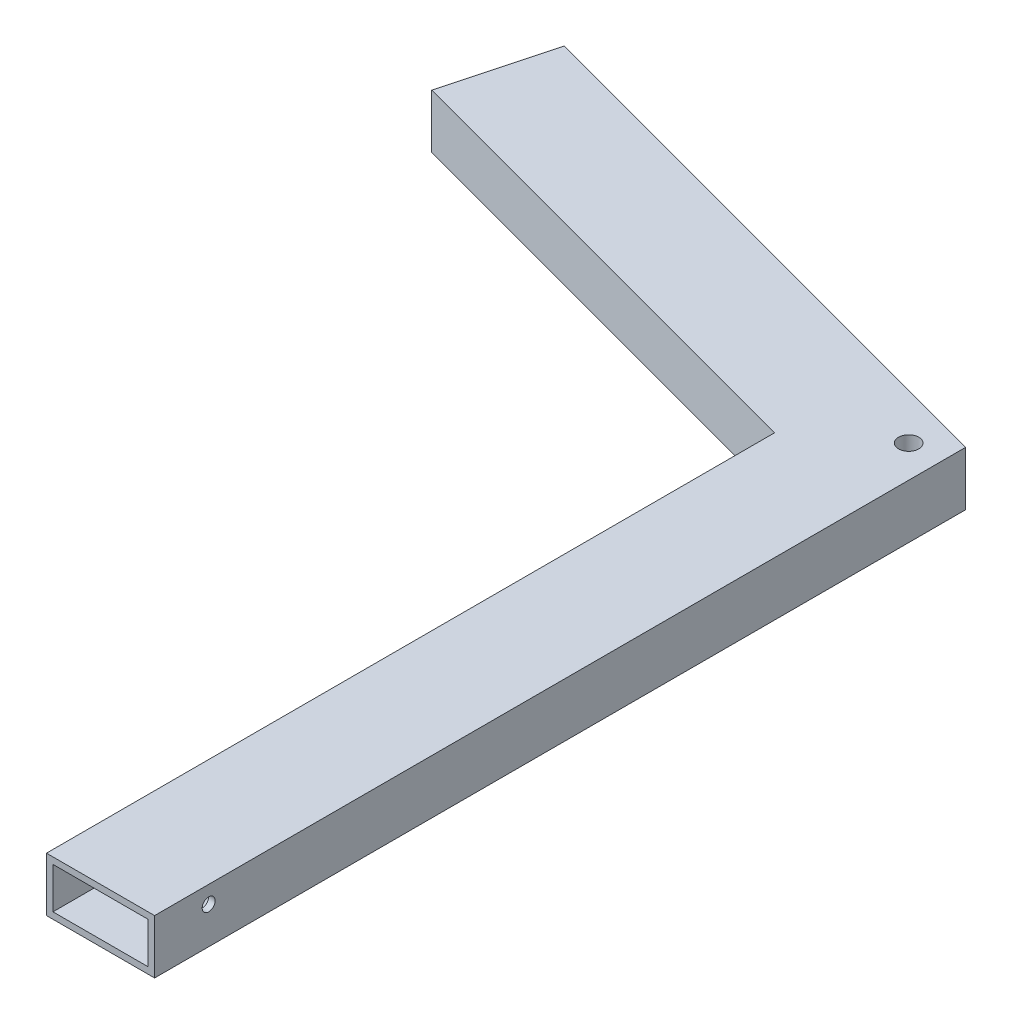
ISO-10303-21;
HEADER;
FILE_DESCRIPTION(('STEP AP214'),'2;1');
FILE_NAME('part.step','',(''),(''),'','','');
FILE_SCHEMA(('AUTOMOTIVE_DESIGN { 1 0 10303 214 1 1 1 1 }'));
ENDSEC;
DATA;
#1=APPLICATION_CONTEXT('core data for automotive mechanical design processes');
#2=APPLICATION_PROTOCOL_DEFINITION('international standard','automotive_design',2000,#1);
#3=PRODUCT_CONTEXT('',#1,'mechanical');
#4=PRODUCT('Part','Part','',(#3));
#5=PRODUCT_RELATED_PRODUCT_CATEGORY('part','',(#4));
#6=PRODUCT_DEFINITION_FORMATION('','',#4);
#7=PRODUCT_DEFINITION_CONTEXT('part definition',#1,'design');
#8=PRODUCT_DEFINITION('design','',#6,#7);
#9=PRODUCT_DEFINITION_SHAPE('','',#8);
#10=(LENGTH_UNIT() NAMED_UNIT(*) SI_UNIT(.MILLI.,.METRE.));
#11=(NAMED_UNIT(*) PLANE_ANGLE_UNIT() SI_UNIT($,.RADIAN.));
#12=(NAMED_UNIT(*) SI_UNIT($,.STERADIAN.) SOLID_ANGLE_UNIT());
#13=UNCERTAINTY_MEASURE_WITH_UNIT(LENGTH_MEASURE(1.E-05),#10,'distance_accuracy_value','');
#14=(GEOMETRIC_REPRESENTATION_CONTEXT(3) GLOBAL_UNCERTAINTY_ASSIGNED_CONTEXT((#13)) GLOBAL_UNIT_ASSIGNED_CONTEXT((#10,
#11,#12)) REPRESENTATION_CONTEXT('',''));
#15=CARTESIAN_POINT('',(0.,0.,0.));
#16=DIRECTION('',(0.,0.,1.));
#17=DIRECTION('',(1.,0.,0.));
#18=AXIS2_PLACEMENT_3D('',#15,#16,#17);
#19=CARTESIAN_POINT('',(-257.612417871295,25.4,-259.527039328841));
#20=DIRECTION('',(0.965925826289069,0.,0.258819045102517));
#21=DIRECTION('',(0.258819045102517,0.,-0.965925826289069));
#22=AXIS2_PLACEMENT_3D('',#19,#20,#21);
#23=PLANE('',#22);
#24=DIRECTION('',(0.,-1.,0.));
#25=VECTOR('',#24,1.);
#26=CARTESIAN_POINT('',(-269.971544913032,22.352,-213.40214927188));
#27=LINE('',#26,#25);
#28=CARTESIAN_POINT('',(-269.971544913032,22.352,-213.40214927188));
#29=VERTEX_POINT('',#28);
#30=CARTESIAN_POINT('',(-269.971544913032,3.048,-213.40214927188));
#31=VERTEX_POINT('',#30);
#32=EDGE_CURVE('E167',#29,#31,#27,.T.);
#33=ORIENTED_EDGE('',*,*,#32,.T.);
#34=DIRECTION('',(0.258819045102517,0.,-0.965925826289069));
#35=VECTOR('',#34,1.);
#36=CARTESIAN_POINT('',(-258.401298320769,3.048,-256.582897410306));
#37=LINE('',#36,#35);
#38=CARTESIAN_POINT('',(-258.401298320769,3.048,-256.582897410306));
#39=VERTEX_POINT('',#38);
#40=EDGE_CURVE('E145',#31,#39,#37,.T.);
#41=ORIENTED_EDGE('',*,*,#40,.T.);
#42=DIRECTION('',(0.,1.,0.));
#43=VECTOR('',#42,1.);
#44=CARTESIAN_POINT('',(-258.401298320769,22.352,-256.582897410306));
#45=LINE('',#44,#43);
#46=CARTESIAN_POINT('',(-258.401298320769,22.352,-256.582897410306));
#47=VERTEX_POINT('',#46);
#48=EDGE_CURVE('E141',#39,#47,#45,.T.);
#49=ORIENTED_EDGE('',*,*,#48,.T.);
#50=DIRECTION('',(-0.258819045102517,0.,0.965925826289069));
#51=VECTOR('',#50,1.);
#52=CARTESIAN_POINT('',(-258.401298320769,22.352,-256.582897410306));
#53=LINE('',#52,#51);
#54=EDGE_CURVE('E174',#47,#29,#53,.T.);
#55=ORIENTED_EDGE('',*,*,#54,.T.);
#56=EDGE_LOOP('',(#33,#41,#49,#55));
#57=FACE_BOUND('',#56,.T.);
#58=DIRECTION('',(-0.258819045102517,0.,0.965925826289069));
#59=VECTOR('',#58,1.);
#60=CARTESIAN_POINT('',(-257.612417871295,0.,-259.527039328841));
#61=LINE('',#60,#59);
#62=CARTESIAN_POINT('',(-257.612417871295,0.,-259.527039328841));
#63=VERTEX_POINT('',#62);
#64=CARTESIAN_POINT('',(-270.760425362503,0.,-210.458007353357));
#65=VERTEX_POINT('',#64);
#66=EDGE_CURVE('E202',#63,#65,#61,.T.);
#67=ORIENTED_EDGE('',*,*,#66,.T.);
#68=DIRECTION('',(0.,-1.,0.));
#69=VECTOR('',#68,1.);
#70=CARTESIAN_POINT('',(-270.760425362503,25.4,-210.458007353357));
#71=LINE('',#70,#69);
#72=CARTESIAN_POINT('',(-270.760425362503,25.4,-210.458007353357));
#73=VERTEX_POINT('',#72);
#74=EDGE_CURVE('E11',#73,#65,#71,.T.);
#75=ORIENTED_EDGE('',*,*,#74,.F.);
#76=DIRECTION('',(-0.258819045102517,0.,0.965925826289069));
#77=VECTOR('',#76,1.);
#78=CARTESIAN_POINT('',(-257.612417871295,25.4,-259.527039328841));
#79=LINE('',#78,#77);
#80=CARTESIAN_POINT('',(-257.612417871295,25.4,-259.527039328841));
#81=VERTEX_POINT('',#80);
#82=EDGE_CURVE('E204',#81,#73,#79,.T.);
#83=ORIENTED_EDGE('',*,*,#82,.F.);
#84=DIRECTION('',(0.,-1.,0.));
#85=VECTOR('',#84,1.);
#86=CARTESIAN_POINT('',(-257.612417871295,25.4,-259.527039328841));
#87=LINE('',#86,#85);
#88=EDGE_CURVE('E219',#81,#63,#87,.T.);
#89=ORIENTED_EDGE('',*,*,#88,.T.);
#90=EDGE_LOOP('',(#67,#75,#83,#89));
#91=FACE_BOUND('',#90,.T.);
#92=ADVANCED_FACE('F36',(#57,#91),#23,.F.);
#93=CARTESIAN_POINT('',(-270.760425362503,25.4,-210.458007353357));
#94=DIRECTION('',(0.258819045102518,0.,-0.965925826289069));
#95=DIRECTION('',(-0.965925826289069,0.,-0.258819045102518));
#96=AXIS2_PLACEMENT_3D('',#93,#94,#95);
#97=PLANE('',#96);
#98=DIRECTION('',(0.965925826289069,0.,0.258819045102518));
#99=VECTOR('',#98,1.);
#100=CARTESIAN_POINT('',(-270.760425362503,0.,-210.458007353357));
#101=LINE('',#100,#99);
#102=CARTESIAN_POINT('',(-50.8,0.,-151.519789010669));
#103=VERTEX_POINT('',#102);
#104=EDGE_CURVE('E222',#65,#103,#101,.T.);
#105=ORIENTED_EDGE('',*,*,#104,.T.);
#106=DIRECTION('',(0.,-1.,0.));
#107=VECTOR('',#106,1.);
#108=CARTESIAN_POINT('',(-50.8,25.4,-151.519789010669));
#109=LINE('',#108,#107);
#110=CARTESIAN_POINT('',(-50.8,25.4,-151.519789010669));
#111=VERTEX_POINT('',#110);
#112=EDGE_CURVE('E44',#111,#103,#109,.T.);
#113=ORIENTED_EDGE('',*,*,#112,.F.);
#114=DIRECTION('',(0.965925826289069,0.,0.258819045102518));
#115=VECTOR('',#114,1.);
#116=CARTESIAN_POINT('',(-270.760425362503,25.4,-210.458007353357));
#117=LINE('',#116,#115);
#118=EDGE_CURVE('E207',#73,#111,#117,.T.);
#119=ORIENTED_EDGE('',*,*,#118,.F.);
#120=ORIENTED_EDGE('',*,*,#74,.T.);
#121=EDGE_LOOP('',(#105,#113,#119,#120));
#122=FACE_BOUND('',#121,.T.);
#123=ADVANCED_FACE('F265',(#122),#97,.F.);
#124=CARTESIAN_POINT('',(-50.8,25.4,-151.519789010669));
#125=DIRECTION('',(1.,0.,0.));
#126=DIRECTION('',(0.,0.,-1.));
#127=AXIS2_PLACEMENT_3D('',#124,#125,#126);
#128=PLANE('',#127);
#129=CARTESIAN_POINT('',(-50.8,17.272,165.1));
#130=DIRECTION('',(1.,0.,0.));
#131=DIRECTION('',(0.,0.,-1.));
#132=AXIS2_PLACEMENT_3D('',#129,#130,#131);
#133=CIRCLE('',#132,3.04800000000001);
#134=CARTESIAN_POINT('',(-50.8,17.272,162.052));
#135=VERTEX_POINT('',#134);
#136=EDGE_CURVE('E296',#135,#135,#133,.T.);
#137=ORIENTED_EDGE('',*,*,#136,.T.);
#138=EDGE_LOOP('',(#137));
#139=FACE_BOUND('',#138,.T.);
#140=DIRECTION('',(0.,0.,1.));
#141=VECTOR('',#140,1.);
#142=CARTESIAN_POINT('',(-50.8,0.,-151.519789010669));
#143=LINE('',#142,#141);
#144=CARTESIAN_POINT('',(-50.7999999999999,0.,190.5));
#145=VERTEX_POINT('',#144);
#146=EDGE_CURVE('E224',#103,#145,#143,.T.);
#147=ORIENTED_EDGE('',*,*,#146,.T.);
#148=DIRECTION('',(0.,-1.,0.));
#149=VECTOR('',#148,1.);
#150=CARTESIAN_POINT('',(-50.7999999999999,25.4,190.5));
#151=LINE('',#150,#149);
#152=CARTESIAN_POINT('',(-50.7999999999999,25.4,190.5));
#153=VERTEX_POINT('',#152);
#154=EDGE_CURVE('E239',#153,#145,#151,.T.);
#155=ORIENTED_EDGE('',*,*,#154,.F.);
#156=DIRECTION('',(0.,0.,1.));
#157=VECTOR('',#156,1.);
#158=CARTESIAN_POINT('',(-50.8,25.4,-151.519789010669));
#159=LINE('',#158,#157);
#160=EDGE_CURVE('E210',#111,#153,#159,.T.);
#161=ORIENTED_EDGE('',*,*,#160,.F.);
#162=ORIENTED_EDGE('',*,*,#112,.T.);
#163=EDGE_LOOP('',(#147,#155,#161,#162));
#164=FACE_BOUND('',#163,.T.);
#165=ADVANCED_FACE('F247',(#139,#164),#128,.F.);
#166=CARTESIAN_POINT('',(-50.7999999999999,25.4,190.5));
#167=DIRECTION('',(0.,0.,-1.));
#168=DIRECTION('',(-1.,0.,0.));
#169=AXIS2_PLACEMENT_3D('',#166,#167,#168);
#170=PLANE('',#169);
#171=DIRECTION('',(0.,-1.,0.));
#172=VECTOR('',#171,1.);
#173=CARTESIAN_POINT('',(-47.752,22.352,190.5));
#174=LINE('',#173,#172);
#175=CARTESIAN_POINT('',(-47.752,22.352,190.5));
#176=VERTEX_POINT('',#175);
#177=CARTESIAN_POINT('',(-47.752,3.048,190.5));
#178=VERTEX_POINT('',#177);
#179=EDGE_CURVE('E159',#176,#178,#174,.T.);
#180=ORIENTED_EDGE('',*,*,#179,.F.);
#181=DIRECTION('',(-1.,0.,0.));
#182=VECTOR('',#181,1.);
#183=CARTESIAN_POINT('',(-47.752,22.352,190.5));
#184=LINE('',#183,#182);
#185=CARTESIAN_POINT('',(-3.04799999999994,22.352,190.5));
#186=VERTEX_POINT('',#185);
#187=EDGE_CURVE('E59',#186,#176,#184,.T.);
#188=ORIENTED_EDGE('',*,*,#187,.F.);
#189=DIRECTION('',(0.,1.,0.));
#190=VECTOR('',#189,1.);
#191=CARTESIAN_POINT('',(-3.04799999999994,22.352,190.5));
#192=LINE('',#191,#190);
#193=CARTESIAN_POINT('',(-3.04799999999994,3.048,190.5));
#194=VERTEX_POINT('',#193);
#195=EDGE_CURVE('E178',#194,#186,#192,.T.);
#196=ORIENTED_EDGE('',*,*,#195,.F.);
#197=DIRECTION('',(1.,0.,0.));
#198=VECTOR('',#197,1.);
#199=CARTESIAN_POINT('',(-47.752,3.048,190.5));
#200=LINE('',#199,#198);
#201=EDGE_CURVE('E163',#178,#194,#200,.T.);
#202=ORIENTED_EDGE('',*,*,#201,.F.);
#203=EDGE_LOOP('',(#180,#188,#196,#202));
#204=FACE_BOUND('',#203,.T.);
#205=DIRECTION('',(1.,0.,0.));
#206=VECTOR('',#205,1.);
#207=CARTESIAN_POINT('',(-50.7999999999999,0.,190.5));
#208=LINE('',#207,#206);
#209=CARTESIAN_POINT('',(0.,0.,190.5));
#210=VERTEX_POINT('',#209);
#211=EDGE_CURVE('E226',#145,#210,#208,.T.);
#212=ORIENTED_EDGE('',*,*,#211,.T.);
#213=DIRECTION('',(0.,-1.,0.));
#214=VECTOR('',#213,1.);
#215=CARTESIAN_POINT('',(0.,25.4,190.5));
#216=LINE('',#215,#214);
#217=CARTESIAN_POINT('',(0.,25.4,190.5));
#218=VERTEX_POINT('',#217);
#219=EDGE_CURVE('E237',#218,#210,#216,.T.);
#220=ORIENTED_EDGE('',*,*,#219,.F.);
#221=DIRECTION('',(1.,0.,0.));
#222=VECTOR('',#221,1.);
#223=CARTESIAN_POINT('',(-50.7999999999999,25.4,190.5));
#224=LINE('',#223,#222);
#225=EDGE_CURVE('E212',#153,#218,#224,.T.);
#226=ORIENTED_EDGE('',*,*,#225,.F.);
#227=ORIENTED_EDGE('',*,*,#154,.T.);
#228=EDGE_LOOP('',(#212,#220,#226,#227));
#229=FACE_BOUND('',#228,.T.);
#230=ADVANCED_FACE('F258',(#204,#229),#170,.F.);
#231=CARTESIAN_POINT('',(0.,25.4,-190.5));
#232=DIRECTION('',(1.,0.,0.));
#233=DIRECTION('',(0.,0.,-1.));
#234=AXIS2_PLACEMENT_3D('',#231,#232,#233);
#235=PLANE('',#234);
#236=CARTESIAN_POINT('',(0.,17.272,165.1));
#237=DIRECTION('',(1.,0.,0.));
#238=DIRECTION('',(0.,0.,-1.));
#239=AXIS2_PLACEMENT_3D('',#236,#237,#238);
#240=CIRCLE('',#239,3.04800000000001);
#241=CARTESIAN_POINT('',(0.,17.272,162.052));
#242=VERTEX_POINT('',#241);
#243=EDGE_CURVE('E305',#242,#242,#240,.T.);
#244=ORIENTED_EDGE('',*,*,#243,.F.);
#245=EDGE_LOOP('',(#244));
#246=FACE_BOUND('',#245,.T.);
#247=DIRECTION('',(0.,0.,1.));
#248=VECTOR('',#247,1.);
#249=CARTESIAN_POINT('',(0.,0.,-190.5));
#250=LINE('',#249,#248);
#251=CARTESIAN_POINT('',(0.,0.,-190.5));
#252=VERTEX_POINT('',#251);
#253=EDGE_CURVE('E229',#252,#210,#250,.T.);
#254=ORIENTED_EDGE('',*,*,#253,.F.);
#255=DIRECTION('',(0.,-1.,0.));
#256=VECTOR('',#255,1.);
#257=CARTESIAN_POINT('',(0.,25.4,-190.5));
#258=LINE('',#257,#256);
#259=CARTESIAN_POINT('',(0.,25.4,-190.5));
#260=VERTEX_POINT('',#259);
#261=EDGE_CURVE('E235',#260,#252,#258,.T.);
#262=ORIENTED_EDGE('',*,*,#261,.F.);
#263=DIRECTION('',(0.,0.,1.));
#264=VECTOR('',#263,1.);
#265=CARTESIAN_POINT('',(0.,25.4,-190.5));
#266=LINE('',#265,#264);
#267=EDGE_CURVE('E214',#260,#218,#266,.T.);
#268=ORIENTED_EDGE('',*,*,#267,.T.);
#269=ORIENTED_EDGE('',*,*,#219,.T.);
#270=EDGE_LOOP('',(#254,#262,#268,#269));
#271=FACE_BOUND('',#270,.T.);
#272=ADVANCED_FACE('F270',(#246,#271),#235,.T.);
#273=CARTESIAN_POINT('',(0.,25.4,-190.5));
#274=DIRECTION('',(-0.258819045102518,0.,0.965925826289069));
#275=DIRECTION('',(0.965925826289069,0.,0.258819045102518));
#276=AXIS2_PLACEMENT_3D('',#273,#274,#275);
#277=PLANE('',#276);
#278=DIRECTION('',(-0.965925826289069,0.,-0.258819045102518));
#279=VECTOR('',#278,1.);
#280=CARTESIAN_POINT('',(0.,0.,-190.5));
#281=LINE('',#280,#279);
#282=EDGE_CURVE('E208',#252,#63,#281,.T.);
#283=ORIENTED_EDGE('',*,*,#282,.T.);
#284=ORIENTED_EDGE('',*,*,#88,.F.);
#285=DIRECTION('',(-0.965925826289069,0.,-0.258819045102518));
#286=VECTOR('',#285,1.);
#287=CARTESIAN_POINT('',(0.,25.4,-190.5));
#288=LINE('',#287,#286);
#289=EDGE_CURVE('E217',#260,#81,#288,.T.);
#290=ORIENTED_EDGE('',*,*,#289,.F.);
#291=ORIENTED_EDGE('',*,*,#261,.T.);
#292=EDGE_LOOP('',(#283,#284,#290,#291));
#293=FACE_BOUND('',#292,.T.);
#294=ADVANCED_FACE('F272',(#293),#277,.F.);
#295=CARTESIAN_POINT('',(0.,25.4,0.));
#296=DIRECTION('',(0.,1.,0.));
#297=DIRECTION('',(0.,0.,1.));
#298=AXIS2_PLACEMENT_3D('',#295,#296,#297);
#299=PLANE('',#298);
#300=CARTESIAN_POINT('',(-15.113381132548,25.4,-178.903094777384));
#301=DIRECTION('',(0.,-1.,0.));
#302=DIRECTION('',(0.,0.,-1.));
#303=AXIS2_PLACEMENT_3D('',#300,#301,#302);
#304=CIRCLE('',#303,4.7625);
#305=CARTESIAN_POINT('',(-15.113381132548,25.4,-183.665594777384));
#306=VERTEX_POINT('',#305);
#307=EDGE_CURVE('E308',#306,#306,#304,.T.);
#308=ORIENTED_EDGE('',*,*,#307,.T.);
#309=EDGE_LOOP('',(#308));
#310=FACE_BOUND('',#309,.T.);
#311=ORIENTED_EDGE('',*,*,#82,.T.);
#312=ORIENTED_EDGE('',*,*,#118,.T.);
#313=ORIENTED_EDGE('',*,*,#160,.T.);
#314=ORIENTED_EDGE('',*,*,#225,.T.);
#315=ORIENTED_EDGE('',*,*,#267,.F.);
#316=ORIENTED_EDGE('',*,*,#289,.T.);
#317=EDGE_LOOP('',(#311,#312,#313,#314,#315,#316));
#318=FACE_BOUND('',#317,.T.);
#319=ADVANCED_FACE('F262',(#310,#318),#299,.T.);
#320=CARTESIAN_POINT('',(0.,0.,0.));
#321=DIRECTION('',(0.,1.,0.));
#322=DIRECTION('',(0.,0.,1.));
#323=AXIS2_PLACEMENT_3D('',#320,#321,#322);
#324=PLANE('',#323);
#325=CARTESIAN_POINT('',(-15.113381132548,0.,-178.903094777384));
#326=DIRECTION('',(0.,-1.,0.));
#327=DIRECTION('',(0.,0.,-1.));
#328=AXIS2_PLACEMENT_3D('',#325,#326,#327);
#329=CIRCLE('',#328,4.7625);
#330=CARTESIAN_POINT('',(-15.113381132548,0.,-183.665594777384));
#331=VERTEX_POINT('',#330);
#332=EDGE_CURVE('E309',#331,#331,#329,.T.);
#333=ORIENTED_EDGE('',*,*,#332,.F.);
#334=EDGE_LOOP('',(#333));
#335=FACE_BOUND('',#334,.T.);
#336=ORIENTED_EDGE('',*,*,#66,.F.);
#337=ORIENTED_EDGE('',*,*,#282,.F.);
#338=ORIENTED_EDGE('',*,*,#253,.T.);
#339=ORIENTED_EDGE('',*,*,#211,.F.);
#340=ORIENTED_EDGE('',*,*,#146,.F.);
#341=ORIENTED_EDGE('',*,*,#104,.F.);
#342=EDGE_LOOP('',(#336,#337,#338,#339,#340,#341));
#343=FACE_BOUND('',#342,.T.);
#344=ADVANCED_FACE('F253',(#335,#343),#324,.F.);
#345=CARTESIAN_POINT('',(-270.760425362503,25.4,-210.458007353357));
#346=DIRECTION('',(0.258819045102518,0.,-0.965925826289069));
#347=DIRECTION('',(-0.965925826289069,0.,-0.258819045102518));
#348=AXIS2_PLACEMENT_3D('',#345,#346,#347);
#349=PLANE('',#348);
#350=DIRECTION('',(0.,-1.,0.));
#351=VECTOR('',#350,1.);
#352=CARTESIAN_POINT('',(-47.752,22.352,-150.703079872139));
#353=LINE('',#352,#351);
#354=CARTESIAN_POINT('',(-47.752,22.352,-150.703079872139));
#355=VERTEX_POINT('',#354);
#356=CARTESIAN_POINT('',(-47.752,3.048,-150.703079872139));
#357=VERTEX_POINT('',#356);
#358=EDGE_CURVE('E187',#355,#357,#353,.T.);
#359=ORIENTED_EDGE('',*,*,#358,.T.);
#360=DIRECTION('',(0.965925826289069,0.,0.258819045102518));
#361=VECTOR('',#360,1.);
#362=CARTESIAN_POINT('',(-48.8112267571591,3.048,-150.986898826321));
#363=LINE('',#362,#361);
#364=CARTESIAN_POINT('',(-3.04799999999994,3.048,-138.724679173698));
#365=VERTEX_POINT('',#364);
#366=EDGE_CURVE('E192',#357,#365,#363,.T.);
#367=ORIENTED_EDGE('',*,*,#366,.T.);
#368=DIRECTION('',(0.,1.,0.));
#369=VECTOR('',#368,1.);
#370=CARTESIAN_POINT('',(-3.04799999999994,22.352,-138.724679173698));
#371=LINE('',#370,#369);
#372=CARTESIAN_POINT('',(-3.04799999999994,22.352,-138.724679173698));
#373=VERTEX_POINT('',#372);
#374=EDGE_CURVE('E196',#365,#373,#371,.T.);
#375=ORIENTED_EDGE('',*,*,#374,.T.);
#376=DIRECTION('',(-0.965925826289069,0.,-0.258819045102518));
#377=VECTOR('',#376,1.);
#378=CARTESIAN_POINT('',(-48.8112267571591,22.352,-150.986898826321));
#379=LINE('',#378,#377);
#380=EDGE_CURVE('E177',#373,#355,#379,.T.);
#381=ORIENTED_EDGE('',*,*,#380,.T.);
#382=EDGE_LOOP('',(#359,#367,#375,#381));
#383=FACE_BOUND('',#382,.T.);
#384=ADVANCED_FACE('F323',(#383),#349,.F.);
#385=CARTESIAN_POINT('',(-47.752,22.352,-154.939986900775));
#386=DIRECTION('',(0.,1.,0.));
#387=DIRECTION('',(0.,0.,1.));
#388=AXIS2_PLACEMENT_3D('',#385,#386,#387);
#389=PLANE('',#388);
#390=DIRECTION('',(0.,0.,1.));
#391=VECTOR('',#390,1.);
#392=CARTESIAN_POINT('',(-3.04799999999994,22.352,-154.939986900775));
#393=LINE('',#392,#391);
#394=EDGE_CURVE('E195',#373,#186,#393,.T.);
#395=ORIENTED_EDGE('',*,*,#394,.T.);
#396=ORIENTED_EDGE('',*,*,#187,.T.);
#397=DIRECTION('',(0.,0.,1.));
#398=VECTOR('',#397,1.);
#399=CARTESIAN_POINT('',(-47.752,22.352,-154.939986900775));
#400=LINE('',#399,#398);
#401=EDGE_CURVE('E186',#355,#176,#400,.T.);
#402=ORIENTED_EDGE('',*,*,#401,.F.);
#403=ORIENTED_EDGE('',*,*,#380,.F.);
#404=EDGE_LOOP('',(#395,#396,#402,#403));
#405=FACE_BOUND('',#404,.T.);
#406=ADVANCED_FACE('F327',(#405),#389,.F.);
#407=CARTESIAN_POINT('',(-3.04799999999994,22.352,-154.939986900775));
#408=DIRECTION('',(1.,0.,0.));
#409=DIRECTION('',(0.,0.,-1.));
#410=AXIS2_PLACEMENT_3D('',#407,#408,#409);
#411=PLANE('',#410);
#412=CARTESIAN_POINT('',(-3.04799999999994,17.272,165.1));
#413=DIRECTION('',(1.,0.,0.));
#414=DIRECTION('',(0.,0.,-1.));
#415=AXIS2_PLACEMENT_3D('',#412,#413,#414);
#416=CIRCLE('',#415,3.04800000000001);
#417=CARTESIAN_POINT('',(-3.04799999999994,17.272,162.052));
#418=VERTEX_POINT('',#417);
#419=EDGE_CURVE('E302',#418,#418,#416,.T.);
#420=ORIENTED_EDGE('',*,*,#419,.T.);
#421=EDGE_LOOP('',(#420));
#422=FACE_BOUND('',#421,.T.);
#423=DIRECTION('',(0.,0.,1.));
#424=VECTOR('',#423,1.);
#425=CARTESIAN_POINT('',(-3.04799999999994,3.048,-154.939986900775));
#426=LINE('',#425,#424);
#427=EDGE_CURVE('E191',#365,#194,#426,.T.);
#428=ORIENTED_EDGE('',*,*,#427,.T.);
#429=ORIENTED_EDGE('',*,*,#195,.T.);
#430=ORIENTED_EDGE('',*,*,#394,.F.);
#431=ORIENTED_EDGE('',*,*,#374,.F.);
#432=EDGE_LOOP('',(#428,#429,#430,#431));
#433=FACE_BOUND('',#432,.T.);
#434=ADVANCED_FACE('F333',(#422,#433),#411,.F.);
#435=CARTESIAN_POINT('',(-47.752,3.048,-154.939986900775));
#436=DIRECTION('',(0.,-1.,0.));
#437=DIRECTION('',(0.,0.,-1.));
#438=AXIS2_PLACEMENT_3D('',#435,#436,#437);
#439=PLANE('',#438);
#440=DIRECTION('',(0.,0.,1.));
#441=VECTOR('',#440,1.);
#442=CARTESIAN_POINT('',(-47.752,3.048,-154.939986900775));
#443=LINE('',#442,#441);
#444=EDGE_CURVE('E190',#357,#178,#443,.T.);
#445=ORIENTED_EDGE('',*,*,#444,.T.);
#446=ORIENTED_EDGE('',*,*,#201,.T.);
#447=ORIENTED_EDGE('',*,*,#427,.F.);
#448=ORIENTED_EDGE('',*,*,#366,.F.);
#449=EDGE_LOOP('',(#445,#446,#447,#448));
#450=FACE_BOUND('',#449,.T.);
#451=ADVANCED_FACE('F336',(#450),#439,.F.);
#452=CARTESIAN_POINT('',(-47.752,22.352,-154.939986900775));
#453=DIRECTION('',(-1.,0.,0.));
#454=DIRECTION('',(0.,0.,1.));
#455=AXIS2_PLACEMENT_3D('',#452,#453,#454);
#456=PLANE('',#455);
#457=CARTESIAN_POINT('',(-47.752,17.272,165.1));
#458=DIRECTION('',(-1.,0.,0.));
#459=DIRECTION('',(0.,0.,1.));
#460=AXIS2_PLACEMENT_3D('',#457,#458,#459);
#461=CIRCLE('',#460,3.04800000000001);
#462=CARTESIAN_POINT('',(-47.752,17.272,168.148));
#463=VERTEX_POINT('',#462);
#464=EDGE_CURVE('E39',#463,#463,#461,.T.);
#465=ORIENTED_EDGE('',*,*,#464,.T.);
#466=EDGE_LOOP('',(#465));
#467=FACE_BOUND('',#466,.T.);
#468=ORIENTED_EDGE('',*,*,#401,.T.);
#469=ORIENTED_EDGE('',*,*,#179,.T.);
#470=ORIENTED_EDGE('',*,*,#444,.F.);
#471=ORIENTED_EDGE('',*,*,#358,.F.);
#472=EDGE_LOOP('',(#468,#469,#470,#471));
#473=FACE_BOUND('',#472,.T.);
#474=ADVANCED_FACE('F340',(#467,#473),#456,.F.);
#475=CARTESIAN_POINT('',(-260.600902574396,22.352,-257.172279593733));
#476=DIRECTION('',(0.,-1.,0.));
#477=DIRECTION('',(0.,0.,-1.));
#478=AXIS2_PLACEMENT_3D('',#475,#476,#477);
#479=PLANE('',#478);
#480=DIRECTION('',(0.,0.,1.));
#481=VECTOR('',#480,1.);
#482=CARTESIAN_POINT('',(-50.8,22.352,-257.172279593733));
#483=LINE('',#482,#481);
#484=CARTESIAN_POINT('',(-50.8,22.352,-200.956297177604));
#485=VERTEX_POINT('',#484);
#486=CARTESIAN_POINT('',(-50.7999999999999,22.352,-154.675310808552));
#487=VERTEX_POINT('',#486);
#488=EDGE_CURVE('E153',#485,#487,#483,.T.);
#489=ORIENTED_EDGE('',*,*,#488,.T.);
#490=DIRECTION('',(0.965925826289069,0.,0.258819045102519));
#491=VECTOR('',#490,1.);
#492=CARTESIAN_POINT('',(-272.171149166659,22.352,-213.991531455307));
#493=LINE('',#492,#491);
#494=EDGE_CURVE('E171',#29,#487,#493,.T.);
#495=ORIENTED_EDGE('',*,*,#494,.F.);
#496=ORIENTED_EDGE('',*,*,#54,.F.);
#497=DIRECTION('',(0.965925826289069,0.,0.258819045102519));
#498=VECTOR('',#497,1.);
#499=CARTESIAN_POINT('',(-260.600902574396,22.352,-257.172279593733));
#500=LINE('',#499,#498);
#501=EDGE_CURVE('E51',#47,#485,#500,.T.);
#502=ORIENTED_EDGE('',*,*,#501,.T.);
#503=EDGE_LOOP('',(#489,#495,#496,#502));
#504=FACE_BOUND('',#503,.T.);
#505=ADVANCED_FACE('F295',(#504),#479,.T.);
#506=CARTESIAN_POINT('',(-272.171149166659,22.352,-213.991531455307));
#507=DIRECTION('',(0.258819045102519,0.,-0.965925826289069));
#508=DIRECTION('',(-0.965925826289069,0.,-0.258819045102519));
#509=AXIS2_PLACEMENT_3D('',#506,#507,#508);
#510=PLANE('',#509);
#511=DIRECTION('',(0.,-1.,0.));
#512=VECTOR('',#511,1.);
#513=CARTESIAN_POINT('',(-50.8,22.352,-154.675310808552));
#514=LINE('',#513,#512);
#515=CARTESIAN_POINT('',(-50.8,3.048,-154.675310808552));
#516=VERTEX_POINT('',#515);
#517=EDGE_CURVE('E160',#487,#516,#514,.T.);
#518=ORIENTED_EDGE('',*,*,#517,.T.);
#519=DIRECTION('',(0.965925826289069,0.,0.258819045102519));
#520=VECTOR('',#519,1.);
#521=CARTESIAN_POINT('',(-272.171149166659,3.048,-213.991531455307));
#522=LINE('',#521,#520);
#523=EDGE_CURVE('E157',#31,#516,#522,.T.);
#524=ORIENTED_EDGE('',*,*,#523,.F.);
#525=ORIENTED_EDGE('',*,*,#32,.F.);
#526=ORIENTED_EDGE('',*,*,#494,.T.);
#527=EDGE_LOOP('',(#518,#524,#525,#526));
#528=FACE_BOUND('',#527,.T.);
#529=ADVANCED_FACE('F293',(#528),#510,.T.);
#530=CARTESIAN_POINT('',(-260.600902574396,3.048,-257.172279593733));
#531=DIRECTION('',(0.,1.,0.));
#532=DIRECTION('',(0.,0.,1.));
#533=AXIS2_PLACEMENT_3D('',#530,#531,#532);
#534=PLANE('',#533);
#535=DIRECTION('',(0.,0.,-1.));
#536=VECTOR('',#535,1.);
#537=CARTESIAN_POINT('',(-50.8,3.048,-257.172279593733));
#538=LINE('',#537,#536);
#539=CARTESIAN_POINT('',(-50.7999999999999,3.048,-200.956297177604));
#540=VERTEX_POINT('',#539);
#541=EDGE_CURVE('E150',#516,#540,#538,.T.);
#542=ORIENTED_EDGE('',*,*,#541,.T.);
#543=DIRECTION('',(0.965925826289069,0.,0.258819045102519));
#544=VECTOR('',#543,1.);
#545=CARTESIAN_POINT('',(-260.600902574396,3.048,-257.172279593733));
#546=LINE('',#545,#544);
#547=EDGE_CURVE('E136',#39,#540,#546,.T.);
#548=ORIENTED_EDGE('',*,*,#547,.F.);
#549=ORIENTED_EDGE('',*,*,#40,.F.);
#550=ORIENTED_EDGE('',*,*,#523,.T.);
#551=EDGE_LOOP('',(#542,#548,#549,#550));
#552=FACE_BOUND('',#551,.T.);
#553=ADVANCED_FACE('F155',(#552),#534,.T.);
#554=CARTESIAN_POINT('',(-260.600902574396,22.352,-257.172279593733));
#555=DIRECTION('',(-0.258819045102519,0.,0.965925826289069));
#556=DIRECTION('',(0.965925826289069,0.,0.258819045102519));
#557=AXIS2_PLACEMENT_3D('',#554,#555,#556);
#558=PLANE('',#557);
#559=DIRECTION('',(0.,1.,0.));
#560=VECTOR('',#559,1.);
#561=CARTESIAN_POINT('',(-50.8,22.352,-200.956297177604));
#562=LINE('',#561,#560);
#563=EDGE_CURVE('E139',#540,#485,#562,.T.);
#564=ORIENTED_EDGE('',*,*,#563,.T.);
#565=ORIENTED_EDGE('',*,*,#501,.F.);
#566=ORIENTED_EDGE('',*,*,#48,.F.);
#567=ORIENTED_EDGE('',*,*,#547,.T.);
#568=EDGE_LOOP('',(#564,#565,#566,#567));
#569=FACE_BOUND('',#568,.T.);
#570=ADVANCED_FACE('F138',(#569),#558,.T.);
#571=CARTESIAN_POINT('',(-50.8,25.4,-151.519789010669));
#572=DIRECTION('',(1.,0.,0.));
#573=DIRECTION('',(0.,0.,-1.));
#574=AXIS2_PLACEMENT_3D('',#571,#572,#573);
#575=PLANE('',#574);
#576=ORIENTED_EDGE('',*,*,#563,.F.);
#577=ORIENTED_EDGE('',*,*,#541,.F.);
#578=ORIENTED_EDGE('',*,*,#517,.F.);
#579=ORIENTED_EDGE('',*,*,#488,.F.);
#580=EDGE_LOOP('',(#576,#577,#578,#579));
#581=FACE_BOUND('',#580,.T.);
#582=ADVANCED_FACE('F149',(#581),#575,.F.);
#583=CARTESIAN_POINT('',(-114.3,17.272,165.1));
#584=DIRECTION('',(1.,0.,0.));
#585=DIRECTION('',(0.,0.,-1.));
#586=AXIS2_PLACEMENT_3D('',#583,#584,#585);
#587=CYLINDRICAL_SURFACE('',#586,3.04800000000001);
#588=ORIENTED_EDGE('',*,*,#464,.F.);
#589=EDGE_LOOP('',(#588));
#590=FACE_BOUND('',#589,.T.);
#591=ORIENTED_EDGE('',*,*,#136,.F.);
#592=EDGE_LOOP('',(#591));
#593=FACE_BOUND('',#592,.T.);
#594=ADVANCED_FACE('F347',(#590,#593),#587,.F.);
#595=ORIENTED_EDGE('',*,*,#243,.T.);
#596=EDGE_LOOP('',(#595));
#597=FACE_BOUND('',#596,.T.);
#598=ORIENTED_EDGE('',*,*,#419,.F.);
#599=EDGE_LOOP('',(#598));
#600=FACE_BOUND('',#599,.T.);
#601=ADVANCED_FACE('F318',(#597,#600),#587,.F.);
#602=CARTESIAN_POINT('',(-15.113381132548,25.4,-178.903094777384));
#603=DIRECTION('',(0.,-1.,0.));
#604=DIRECTION('',(0.,0.,-1.));
#605=AXIS2_PLACEMENT_3D('',#602,#603,#604);
#606=CYLINDRICAL_SURFACE('',#605,4.7625);
#607=ORIENTED_EDGE('',*,*,#307,.F.);
#608=EDGE_LOOP('',(#607));
#609=FACE_BOUND('',#608,.T.);
#610=ORIENTED_EDGE('',*,*,#332,.T.);
#611=EDGE_LOOP('',(#610));
#612=FACE_BOUND('',#611,.T.);
#613=ADVANCED_FACE('F315',(#609,#612),#606,.F.);
#614=CLOSED_SHELL('',(#92,#123,#165,#230,#272,#294,#319,#344,#384,#406,#434,#451,#474,#505,#529,
#553,#570,#582,#594,#601,#613));
#615=MANIFOLD_SOLID_BREP('B2',#614);
#616=ADVANCED_BREP_SHAPE_REPRESENTATION('',(#18,#615),#14);
#617=SHAPE_DEFINITION_REPRESENTATION(#9,#616);
ENDSEC;
END-ISO-10303-21;
